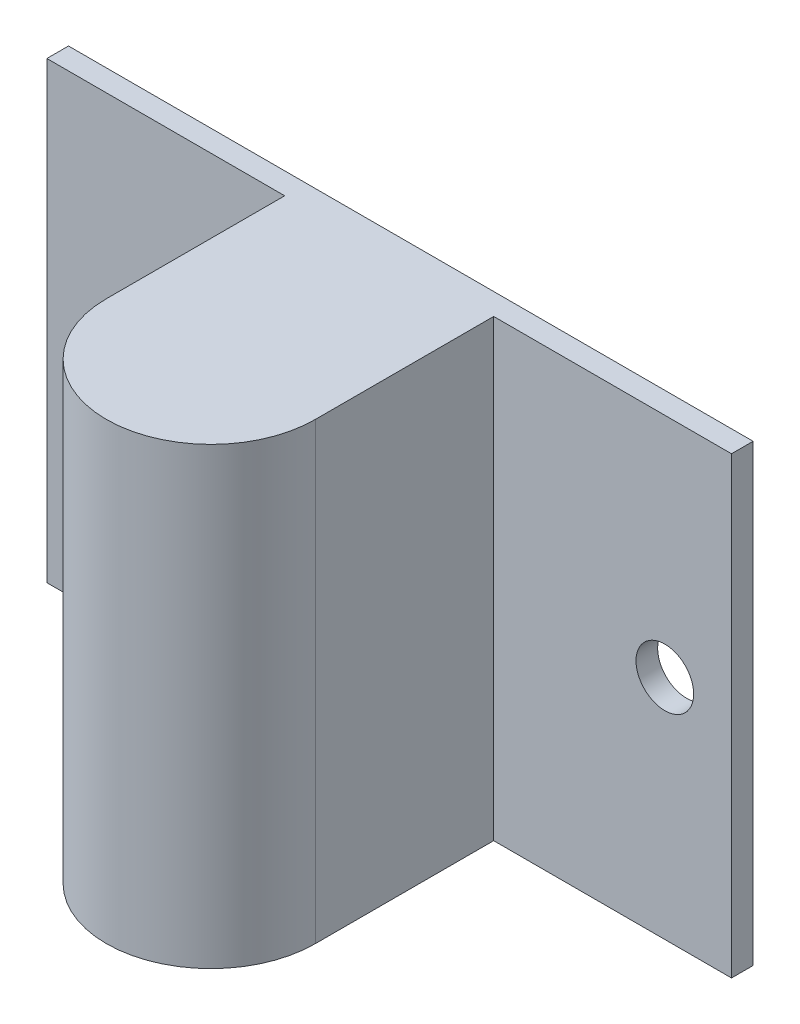
ISO-10303-21;
HEADER;
FILE_DESCRIPTION(('STEP AP214'),'2;1');
FILE_NAME('part.step','',(''),(''),'','','');
FILE_SCHEMA(('AUTOMOTIVE_DESIGN { 1 0 10303 214 1 1 1 1 }'));
ENDSEC;
DATA;
#1=APPLICATION_CONTEXT('core data for automotive mechanical design processes');
#2=APPLICATION_PROTOCOL_DEFINITION('international standard','automotive_design',2000,#1);
#3=PRODUCT_CONTEXT('',#1,'mechanical');
#4=PRODUCT('Part','Part','',(#3));
#5=PRODUCT_RELATED_PRODUCT_CATEGORY('part','',(#4));
#6=PRODUCT_DEFINITION_FORMATION('','',#4);
#7=PRODUCT_DEFINITION_CONTEXT('part definition',#1,'design');
#8=PRODUCT_DEFINITION('design','',#6,#7);
#9=PRODUCT_DEFINITION_SHAPE('','',#8);
#10=(LENGTH_UNIT() NAMED_UNIT(*) SI_UNIT(.MILLI.,.METRE.));
#11=(NAMED_UNIT(*) PLANE_ANGLE_UNIT() SI_UNIT($,.RADIAN.));
#12=(NAMED_UNIT(*) SI_UNIT($,.STERADIAN.) SOLID_ANGLE_UNIT());
#13=UNCERTAINTY_MEASURE_WITH_UNIT(LENGTH_MEASURE(1.E-05),#10,'distance_accuracy_value','');
#14=(GEOMETRIC_REPRESENTATION_CONTEXT(3) GLOBAL_UNCERTAINTY_ASSIGNED_CONTEXT((#13)) GLOBAL_UNIT_ASSIGNED_CONTEXT((#10,
#11,#12)) REPRESENTATION_CONTEXT('',''));
#15=CARTESIAN_POINT('',(0.,0.,0.));
#16=DIRECTION('',(0.,0.,1.));
#17=DIRECTION('',(1.,0.,0.));
#18=AXIS2_PLACEMENT_3D('',#15,#16,#17);
#19=CARTESIAN_POINT('',(0.,0.,1.905));
#20=DIRECTION('',(0.,-1.,0.));
#21=DIRECTION('',(0.,0.,-1.));
#22=AXIS2_PLACEMENT_3D('',#19,#20,#21);
#23=CYLINDRICAL_SURFACE('',#22,7.366);
#24=DIRECTION('',(0.,-1.,0.));
#25=VECTOR('',#24,1.);
#26=CARTESIAN_POINT('',(-7.366,32.004,1.905));
#27=LINE('',#26,#25);
#28=CARTESIAN_POINT('',(-7.366,0.,1.905));
#29=VERTEX_POINT('',#28);
#30=CARTESIAN_POINT('',(-7.366,32.004,1.905));
#31=VERTEX_POINT('',#30);
#32=EDGE_CURVE('E112',#29,#31,#27,.F.);
#33=ORIENTED_EDGE('',*,*,#32,.F.);
#34=CARTESIAN_POINT('',(0.,0.,1.905));
#35=DIRECTION('',(0.,1.,0.));
#36=DIRECTION('',(0.,0.,1.));
#37=AXIS2_PLACEMENT_3D('',#34,#35,#36);
#38=CIRCLE('',#37,7.366);
#39=CARTESIAN_POINT('',(7.366,0.,1.905));
#40=VERTEX_POINT('',#39);
#41=EDGE_CURVE('E48',#40,#29,#38,.F.);
#42=ORIENTED_EDGE('',*,*,#41,.F.);
#43=DIRECTION('',(0.,1.,0.));
#44=VECTOR('',#43,1.);
#45=CARTESIAN_POINT('',(7.366,0.,1.905));
#46=LINE('',#45,#44);
#47=CARTESIAN_POINT('',(7.366,32.004,1.905));
#48=VERTEX_POINT('',#47);
#49=EDGE_CURVE('E165',#48,#40,#46,.F.);
#50=ORIENTED_EDGE('',*,*,#49,.F.);
#51=CARTESIAN_POINT('',(0.,32.004,1.905));
#52=DIRECTION('',(0.,1.,0.));
#53=DIRECTION('',(0.,0.,1.));
#54=AXIS2_PLACEMENT_3D('',#51,#52,#53);
#55=CIRCLE('',#54,7.366);
#56=EDGE_CURVE('E11',#31,#48,#55,.T.);
#57=ORIENTED_EDGE('',*,*,#56,.F.);
#58=EDGE_LOOP('',(#33,#42,#50,#57));
#59=FACE_BOUND('',#58,.T.);
#60=ADVANCED_FACE('F39',(#59),#23,.T.);
#61=CARTESIAN_POINT('',(7.366,32.004,0.));
#62=DIRECTION('',(1.,0.,0.));
#63=DIRECTION('',(0.,0.,-1.));
#64=AXIS2_PLACEMENT_3D('',#61,#62,#63);
#65=PLANE('',#64);
#66=DIRECTION('',(0.,0.,1.));
#67=VECTOR('',#66,1.);
#68=CARTESIAN_POINT('',(7.366,32.004,0.));
#69=LINE('',#68,#67);
#70=CARTESIAN_POINT('',(7.366,32.004,-10.668));
#71=VERTEX_POINT('',#70);
#72=EDGE_CURVE('E106',#71,#48,#69,.T.);
#73=ORIENTED_EDGE('',*,*,#72,.T.);
#74=ORIENTED_EDGE('',*,*,#49,.T.);
#75=DIRECTION('',(0.,0.,1.));
#76=VECTOR('',#75,1.);
#77=CARTESIAN_POINT('',(7.366,0.,0.));
#78=LINE('',#77,#76);
#79=CARTESIAN_POINT('',(7.366,0.,-10.668));
#80=VERTEX_POINT('',#79);
#81=EDGE_CURVE('E108',#80,#40,#78,.T.);
#82=ORIENTED_EDGE('',*,*,#81,.F.);
#83=DIRECTION('',(0.,-1.,0.));
#84=VECTOR('',#83,1.);
#85=CARTESIAN_POINT('',(7.366,32.004,-10.668));
#86=LINE('',#85,#84);
#87=EDGE_CURVE('E103',#71,#80,#86,.T.);
#88=ORIENTED_EDGE('',*,*,#87,.F.);
#89=EDGE_LOOP('',(#73,#74,#82,#88));
#90=FACE_BOUND('',#89,.T.);
#91=ADVANCED_FACE('F105',(#90),#65,.T.);
#92=CARTESIAN_POINT('',(0.,32.004,-10.668));
#93=DIRECTION('',(0.,0.,-1.));
#94=DIRECTION('',(-1.,0.,0.));
#95=AXIS2_PLACEMENT_3D('',#92,#93,#94);
#96=PLANE('',#95);
#97=CARTESIAN_POINT('',(19.431,16.002,-10.668));
#98=DIRECTION('',(0.,0.,-1.));
#99=DIRECTION('',(-1.,0.,0.));
#100=AXIS2_PLACEMENT_3D('',#97,#98,#99);
#101=CIRCLE('',#100,2.032);
#102=CARTESIAN_POINT('',(17.399,16.002,-10.668));
#103=VERTEX_POINT('',#102);
#104=EDGE_CURVE('E130',#103,#103,#101,.T.);
#105=ORIENTED_EDGE('',*,*,#104,.T.);
#106=EDGE_LOOP('',(#105));
#107=FACE_BOUND('',#106,.T.);
#108=DIRECTION('',(1.,0.,0.));
#109=VECTOR('',#108,1.);
#110=CARTESIAN_POINT('',(0.,0.,-10.668));
#111=LINE('',#110,#109);
#112=CARTESIAN_POINT('',(24.13,0.,-10.668));
#113=VERTEX_POINT('',#112);
#114=EDGE_CURVE('E143',#80,#113,#111,.T.);
#115=ORIENTED_EDGE('',*,*,#114,.T.);
#116=DIRECTION('',(0.,-1.,0.));
#117=VECTOR('',#116,1.);
#118=CARTESIAN_POINT('',(24.13,32.004,-10.668));
#119=LINE('',#118,#117);
#120=CARTESIAN_POINT('',(24.13,32.004,-10.668));
#121=VERTEX_POINT('',#120);
#122=EDGE_CURVE('E113',#121,#113,#119,.T.);
#123=ORIENTED_EDGE('',*,*,#122,.F.);
#124=DIRECTION('',(1.,0.,0.));
#125=VECTOR('',#124,1.);
#126=CARTESIAN_POINT('',(0.,32.004,-10.668));
#127=LINE('',#126,#125);
#128=EDGE_CURVE('E116',#71,#121,#127,.T.);
#129=ORIENTED_EDGE('',*,*,#128,.F.);
#130=ORIENTED_EDGE('',*,*,#87,.T.);
#131=EDGE_LOOP('',(#115,#123,#129,#130));
#132=FACE_BOUND('',#131,.T.);
#133=ADVANCED_FACE('F117',(#107,#132),#96,.F.);
#134=CARTESIAN_POINT('',(24.13,32.004,0.));
#135=DIRECTION('',(1.,0.,0.));
#136=DIRECTION('',(0.,0.,-1.));
#137=AXIS2_PLACEMENT_3D('',#134,#135,#136);
#138=PLANE('',#137);
#139=DIRECTION('',(0.,0.,1.));
#140=VECTOR('',#139,1.);
#141=CARTESIAN_POINT('',(24.13,0.,0.));
#142=LINE('',#141,#140);
#143=CARTESIAN_POINT('',(24.13,0.,-12.192));
#144=VERTEX_POINT('',#143);
#145=EDGE_CURVE('E145',#144,#113,#142,.T.);
#146=ORIENTED_EDGE('',*,*,#145,.F.);
#147=DIRECTION('',(0.,-1.,0.));
#148=VECTOR('',#147,1.);
#149=CARTESIAN_POINT('',(24.13,32.004,-12.192));
#150=LINE('',#149,#148);
#151=CARTESIAN_POINT('',(24.13,32.004,-12.192));
#152=VERTEX_POINT('',#151);
#153=EDGE_CURVE('E160',#152,#144,#150,.T.);
#154=ORIENTED_EDGE('',*,*,#153,.F.);
#155=DIRECTION('',(0.,0.,1.));
#156=VECTOR('',#155,1.);
#157=CARTESIAN_POINT('',(24.13,32.004,0.));
#158=LINE('',#157,#156);
#159=EDGE_CURVE('E120',#152,#121,#158,.T.);
#160=ORIENTED_EDGE('',*,*,#159,.T.);
#161=ORIENTED_EDGE('',*,*,#122,.T.);
#162=EDGE_LOOP('',(#146,#154,#160,#161));
#163=FACE_BOUND('',#162,.T.);
#164=ADVANCED_FACE('F188',(#163),#138,.T.);
#165=CARTESIAN_POINT('',(0.,32.004,-12.192));
#166=DIRECTION('',(0.,0.,-1.));
#167=DIRECTION('',(-1.,0.,0.));
#168=AXIS2_PLACEMENT_3D('',#165,#166,#167);
#169=PLANE('',#168);
#170=CARTESIAN_POINT('',(-19.304,16.002,-12.192));
#171=DIRECTION('',(0.,0.,-1.));
#172=DIRECTION('',(-1.,0.,0.));
#173=AXIS2_PLACEMENT_3D('',#170,#171,#172);
#174=CIRCLE('',#173,2.032);
#175=CARTESIAN_POINT('',(-21.336,16.002,-12.192));
#176=VERTEX_POINT('',#175);
#177=EDGE_CURVE('E325',#176,#176,#174,.T.);
#178=ORIENTED_EDGE('',*,*,#177,.F.);
#179=EDGE_LOOP('',(#178));
#180=FACE_BOUND('',#179,.T.);
#181=CARTESIAN_POINT('',(19.431,16.002,-12.192));
#182=DIRECTION('',(0.,0.,-1.));
#183=DIRECTION('',(-1.,0.,0.));
#184=AXIS2_PLACEMENT_3D('',#181,#182,#183);
#185=CIRCLE('',#184,2.032);
#186=CARTESIAN_POINT('',(17.399,16.002,-12.192));
#187=VERTEX_POINT('',#186);
#188=EDGE_CURVE('E321',#187,#187,#185,.T.);
#189=ORIENTED_EDGE('',*,*,#188,.F.);
#190=EDGE_LOOP('',(#189));
#191=FACE_BOUND('',#190,.T.);
#192=DIRECTION('',(1.,0.,0.));
#193=VECTOR('',#192,1.);
#194=CARTESIAN_POINT('',(0.,0.,-12.192));
#195=LINE('',#194,#193);
#196=CARTESIAN_POINT('',(-24.13,0.,-12.192));
#197=VERTEX_POINT('',#196);
#198=EDGE_CURVE('E148',#197,#144,#195,.T.);
#199=ORIENTED_EDGE('',*,*,#198,.F.);
#200=DIRECTION('',(0.,-1.,0.));
#201=VECTOR('',#200,1.);
#202=CARTESIAN_POINT('',(-24.13,32.004,-12.192));
#203=LINE('',#202,#201);
#204=CARTESIAN_POINT('',(-24.13,32.004,-12.192));
#205=VERTEX_POINT('',#204);
#206=EDGE_CURVE('E158',#205,#197,#203,.T.);
#207=ORIENTED_EDGE('',*,*,#206,.F.);
#208=DIRECTION('',(1.,0.,0.));
#209=VECTOR('',#208,1.);
#210=CARTESIAN_POINT('',(0.,32.004,-12.192));
#211=LINE('',#210,#209);
#212=EDGE_CURVE('E134',#205,#152,#211,.T.);
#213=ORIENTED_EDGE('',*,*,#212,.T.);
#214=ORIENTED_EDGE('',*,*,#153,.T.);
#215=EDGE_LOOP('',(#199,#207,#213,#214));
#216=FACE_BOUND('',#215,.T.);
#217=ADVANCED_FACE('F183',(#180,#191,#216),#169,.T.);
#218=CARTESIAN_POINT('',(-24.13,32.004,0.));
#219=DIRECTION('',(1.,0.,0.));
#220=DIRECTION('',(0.,0.,-1.));
#221=AXIS2_PLACEMENT_3D('',#218,#219,#220);
#222=PLANE('',#221);
#223=DIRECTION('',(0.,0.,1.));
#224=VECTOR('',#223,1.);
#225=CARTESIAN_POINT('',(-24.13,0.,0.));
#226=LINE('',#225,#224);
#227=CARTESIAN_POINT('',(-24.13,0.,-10.668));
#228=VERTEX_POINT('',#227);
#229=EDGE_CURVE('E151',#197,#228,#226,.T.);
#230=ORIENTED_EDGE('',*,*,#229,.T.);
#231=DIRECTION('',(0.,-1.,0.));
#232=VECTOR('',#231,1.);
#233=CARTESIAN_POINT('',(-24.13,32.004,-10.668));
#234=LINE('',#233,#232);
#235=CARTESIAN_POINT('',(-24.13,32.004,-10.668));
#236=VERTEX_POINT('',#235);
#237=EDGE_CURVE('E155',#236,#228,#234,.T.);
#238=ORIENTED_EDGE('',*,*,#237,.F.);
#239=DIRECTION('',(0.,0.,1.));
#240=VECTOR('',#239,1.);
#241=CARTESIAN_POINT('',(-24.13,32.004,0.));
#242=LINE('',#241,#240);
#243=EDGE_CURVE('E137',#205,#236,#242,.T.);
#244=ORIENTED_EDGE('',*,*,#243,.F.);
#245=ORIENTED_EDGE('',*,*,#206,.T.);
#246=EDGE_LOOP('',(#230,#238,#244,#245));
#247=FACE_BOUND('',#246,.T.);
#248=ADVANCED_FACE('F189',(#247),#222,.F.);
#249=CARTESIAN_POINT('',(-19.304,16.002,-10.668));
#250=DIRECTION('',(0.,0.,-1.));
#251=DIRECTION('',(-1.,0.,0.));
#252=AXIS2_PLACEMENT_3D('',#249,#250,#251);
#253=CIRCLE('',#252,2.032);
#254=CARTESIAN_POINT('',(-21.336,16.002,-10.668));
#255=VERTEX_POINT('',#254);
#256=EDGE_CURVE('E43',#255,#255,#253,.T.);
#257=ORIENTED_EDGE('',*,*,#256,.T.);
#258=EDGE_LOOP('',(#257));
#259=FACE_BOUND('',#258,.T.);
#260=CARTESIAN_POINT('',(-7.366,0.,-10.668));
#261=VERTEX_POINT('',#260);
#262=EDGE_CURVE('E127',#228,#261,#111,.T.);
#263=ORIENTED_EDGE('',*,*,#262,.T.);
#264=DIRECTION('',(0.,-1.,0.));
#265=VECTOR('',#264,1.);
#266=CARTESIAN_POINT('',(-7.366,32.004,-10.668));
#267=LINE('',#266,#265);
#268=CARTESIAN_POINT('',(-7.366,32.004,-10.668));
#269=VERTEX_POINT('',#268);
#270=EDGE_CURVE('E141',#269,#261,#267,.T.);
#271=ORIENTED_EDGE('',*,*,#270,.F.);
#272=EDGE_CURVE('E122',#236,#269,#127,.T.);
#273=ORIENTED_EDGE('',*,*,#272,.F.);
#274=ORIENTED_EDGE('',*,*,#237,.T.);
#275=EDGE_LOOP('',(#263,#271,#273,#274));
#276=FACE_BOUND('',#275,.T.);
#277=ADVANCED_FACE('F177',(#259,#276),#96,.F.);
#278=CARTESIAN_POINT('',(-7.366,32.004,0.));
#279=DIRECTION('',(1.,0.,0.));
#280=DIRECTION('',(0.,0.,-1.));
#281=AXIS2_PLACEMENT_3D('',#278,#279,#280);
#282=PLANE('',#281);
#283=DIRECTION('',(0.,0.,1.));
#284=VECTOR('',#283,1.);
#285=CARTESIAN_POINT('',(-7.366,0.,0.));
#286=LINE('',#285,#284);
#287=EDGE_CURVE('E124',#261,#29,#286,.T.);
#288=ORIENTED_EDGE('',*,*,#287,.T.);
#289=ORIENTED_EDGE('',*,*,#32,.T.);
#290=DIRECTION('',(0.,0.,1.));
#291=VECTOR('',#290,1.);
#292=CARTESIAN_POINT('',(-7.366,32.004,0.));
#293=LINE('',#292,#291);
#294=EDGE_CURVE('E139',#269,#31,#293,.T.);
#295=ORIENTED_EDGE('',*,*,#294,.F.);
#296=ORIENTED_EDGE('',*,*,#270,.T.);
#297=EDGE_LOOP('',(#288,#289,#295,#296));
#298=FACE_BOUND('',#297,.T.);
#299=ADVANCED_FACE('F173',(#298),#282,.F.);
#300=CARTESIAN_POINT('',(0.,32.004,0.));
#301=DIRECTION('',(0.,1.,0.));
#302=DIRECTION('',(0.,0.,1.));
#303=AXIS2_PLACEMENT_3D('',#300,#301,#302);
#304=PLANE('',#303);
#305=ORIENTED_EDGE('',*,*,#294,.T.);
#306=ORIENTED_EDGE('',*,*,#56,.T.);
#307=ORIENTED_EDGE('',*,*,#72,.F.);
#308=ORIENTED_EDGE('',*,*,#128,.T.);
#309=ORIENTED_EDGE('',*,*,#159,.F.);
#310=ORIENTED_EDGE('',*,*,#212,.F.);
#311=ORIENTED_EDGE('',*,*,#243,.T.);
#312=ORIENTED_EDGE('',*,*,#272,.T.);
#313=EDGE_LOOP('',(#305,#306,#307,#308,#309,#310,#311,#312));
#314=FACE_BOUND('',#313,.T.);
#315=ADVANCED_FACE('F123',(#314),#304,.T.);
#316=CARTESIAN_POINT('',(0.,0.,0.));
#317=DIRECTION('',(0.,1.,0.));
#318=DIRECTION('',(0.,0.,1.));
#319=AXIS2_PLACEMENT_3D('',#316,#317,#318);
#320=PLANE('',#319);
#321=ORIENTED_EDGE('',*,*,#81,.T.);
#322=ORIENTED_EDGE('',*,*,#41,.T.);
#323=ORIENTED_EDGE('',*,*,#287,.F.);
#324=ORIENTED_EDGE('',*,*,#262,.F.);
#325=ORIENTED_EDGE('',*,*,#229,.F.);
#326=ORIENTED_EDGE('',*,*,#198,.T.);
#327=ORIENTED_EDGE('',*,*,#145,.T.);
#328=ORIENTED_EDGE('',*,*,#114,.F.);
#329=EDGE_LOOP('',(#321,#322,#323,#324,#325,#326,#327,#328));
#330=FACE_BOUND('',#329,.T.);
#331=ADVANCED_FACE('F169',(#330),#320,.F.);
#332=CARTESIAN_POINT('',(-19.304,16.002,19.812));
#333=DIRECTION('',(0.,0.,-1.));
#334=DIRECTION('',(-1.,0.,0.));
#335=AXIS2_PLACEMENT_3D('',#332,#333,#334);
#336=CYLINDRICAL_SURFACE('',#335,2.032);
#337=ORIENTED_EDGE('',*,*,#177,.T.);
#338=EDGE_LOOP('',(#337));
#339=FACE_BOUND('',#338,.T.);
#340=ORIENTED_EDGE('',*,*,#256,.F.);
#341=EDGE_LOOP('',(#340));
#342=FACE_BOUND('',#341,.T.);
#343=ADVANCED_FACE('F236',(#339,#342),#336,.F.);
#344=CARTESIAN_POINT('',(19.431,16.002,19.812));
#345=DIRECTION('',(0.,0.,-1.));
#346=DIRECTION('',(-1.,0.,0.));
#347=AXIS2_PLACEMENT_3D('',#344,#345,#346);
#348=CYLINDRICAL_SURFACE('',#347,2.032);
#349=ORIENTED_EDGE('',*,*,#188,.T.);
#350=EDGE_LOOP('',(#349));
#351=FACE_BOUND('',#350,.T.);
#352=ORIENTED_EDGE('',*,*,#104,.F.);
#353=EDGE_LOOP('',(#352));
#354=FACE_BOUND('',#353,.T.);
#355=ADVANCED_FACE('F241',(#351,#354),#348,.F.);
#356=CLOSED_SHELL('',(#60,#91,#133,#164,#217,#248,#277,#299,#315,#331,#343,#355));
#357=MANIFOLD_SOLID_BREP('B2',#356);
#358=ADVANCED_BREP_SHAPE_REPRESENTATION('',(#18,#357),#14);
#359=SHAPE_DEFINITION_REPRESENTATION(#9,#358);
ENDSEC;
END-ISO-10303-21;
